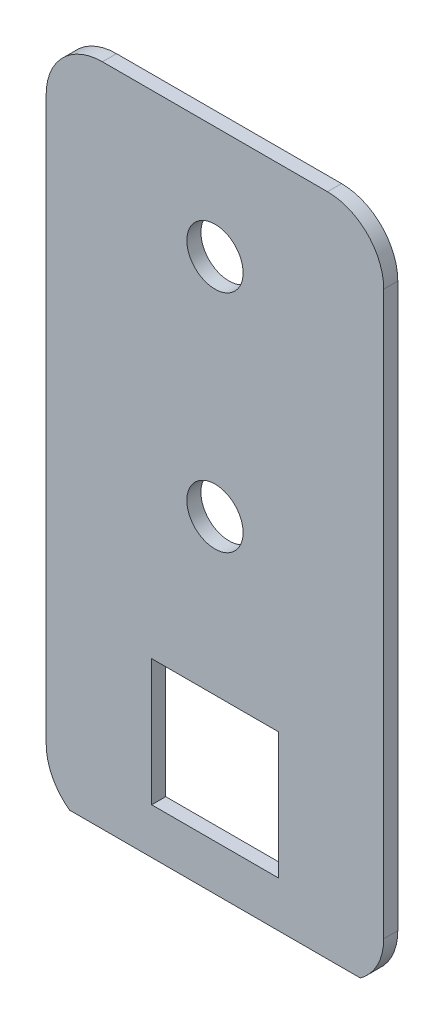
ISO-10303-21;
HEADER;
FILE_DESCRIPTION(('STEP AP214'),'2;1');
FILE_NAME('part.step','',(''),(''),'','','');
FILE_SCHEMA(('AUTOMOTIVE_DESIGN { 1 0 10303 214 1 1 1 1 }'));
ENDSEC;
DATA;
#1=APPLICATION_CONTEXT('core data for automotive mechanical design processes');
#2=APPLICATION_PROTOCOL_DEFINITION('international standard','automotive_design',2000,#1);
#3=PRODUCT_CONTEXT('',#1,'mechanical');
#4=PRODUCT('Part','Part','',(#3));
#5=PRODUCT_RELATED_PRODUCT_CATEGORY('part','',(#4));
#6=PRODUCT_DEFINITION_FORMATION('','',#4);
#7=PRODUCT_DEFINITION_CONTEXT('part definition',#1,'design');
#8=PRODUCT_DEFINITION('design','',#6,#7);
#9=PRODUCT_DEFINITION_SHAPE('','',#8);
#10=(LENGTH_UNIT() NAMED_UNIT(*) SI_UNIT(.MILLI.,.METRE.));
#11=(NAMED_UNIT(*) PLANE_ANGLE_UNIT() SI_UNIT($,.RADIAN.));
#12=(NAMED_UNIT(*) SI_UNIT($,.STERADIAN.) SOLID_ANGLE_UNIT());
#13=UNCERTAINTY_MEASURE_WITH_UNIT(LENGTH_MEASURE(1.E-05),#10,'distance_accuracy_value','');
#14=(GEOMETRIC_REPRESENTATION_CONTEXT(3) GLOBAL_UNCERTAINTY_ASSIGNED_CONTEXT((#13)) GLOBAL_UNIT_ASSIGNED_CONTEXT((#10,
#11,#12)) REPRESENTATION_CONTEXT('',''));
#15=CARTESIAN_POINT('',(0.,0.,0.));
#16=DIRECTION('',(0.,0.,1.));
#17=DIRECTION('',(1.,0.,0.));
#18=AXIS2_PLACEMENT_3D('',#15,#16,#17);
#19=CARTESIAN_POINT('',(6.35,69.85,1.5875));
#20=DIRECTION('',(0.,0.,-1.));
#21=DIRECTION('',(-1.,0.,0.));
#22=AXIS2_PLACEMENT_3D('',#19,#20,#21);
#23=PLANE('',#22);
#24=CARTESIAN_POINT('',(6.35,6.35,1.5875));
#25=DIRECTION('',(0.,0.,1.));
#26=DIRECTION('',(-1.,0.,0.));
#27=AXIS2_PLACEMENT_3D('',#24,#25,#26);
#28=CIRCLE('',#27,6.35);
#29=CARTESIAN_POINT('',(0.,6.35000000000004,1.5875));
#30=VERTEX_POINT('',#29);
#31=CARTESIAN_POINT('',(2.64819643830539,1.19062499999999,1.5875));
#32=VERTEX_POINT('',#31);
#33=EDGE_CURVE('E144',#30,#32,#28,.T.);
#34=ORIENTED_EDGE('',*,*,#33,.T.);
#35=DIRECTION('',(-1.,0.,0.));
#36=VECTOR('',#35,1.);
#37=CARTESIAN_POINT('',(76.2,1.19062499999999,1.5875));
#38=LINE('',#37,#36);
#39=CARTESIAN_POINT('',(35.4518035616946,1.19062499999999,1.5875));
#40=VERTEX_POINT('',#39);
#41=EDGE_CURVE('E133',#40,#32,#38,.T.);
#42=ORIENTED_EDGE('',*,*,#41,.F.);
#43=CARTESIAN_POINT('',(31.75,6.35,1.5875));
#44=DIRECTION('',(0.,0.,1.));
#45=DIRECTION('',(1.,0.,0.));
#46=AXIS2_PLACEMENT_3D('',#43,#44,#45);
#47=CIRCLE('',#46,6.35);
#48=CARTESIAN_POINT('',(38.1,6.35,1.5875));
#49=VERTEX_POINT('',#48);
#50=EDGE_CURVE('E141',#40,#49,#47,.T.);
#51=ORIENTED_EDGE('',*,*,#50,.T.);
#52=DIRECTION('',(0.,1.,0.));
#53=VECTOR('',#52,1.);
#54=CARTESIAN_POINT('',(38.1,6.35000000000004,1.5875));
#55=LINE('',#54,#53);
#56=CARTESIAN_POINT('',(38.1,69.85,1.5875));
#57=VERTEX_POINT('',#56);
#58=EDGE_CURVE('E152',#49,#57,#55,.T.);
#59=ORIENTED_EDGE('',*,*,#58,.T.);
#60=CARTESIAN_POINT('',(31.75,69.85,1.5875));
#61=DIRECTION('',(0.,0.,1.));
#62=DIRECTION('',(-1.,0.,0.));
#63=AXIS2_PLACEMENT_3D('',#60,#61,#62);
#64=CIRCLE('',#63,6.35);
#65=CARTESIAN_POINT('',(31.75,76.2,1.5875));
#66=VERTEX_POINT('',#65);
#67=EDGE_CURVE('E156',#57,#66,#64,.T.);
#68=ORIENTED_EDGE('',*,*,#67,.T.);
#69=DIRECTION('',(-1.,0.,0.));
#70=VECTOR('',#69,1.);
#71=CARTESIAN_POINT('',(6.35000000000004,76.2,1.5875));
#72=LINE('',#71,#70);
#73=CARTESIAN_POINT('',(6.35000000000004,76.2,1.5875));
#74=VERTEX_POINT('',#73);
#75=EDGE_CURVE('E164',#66,#74,#72,.T.);
#76=ORIENTED_EDGE('',*,*,#75,.T.);
#77=CARTESIAN_POINT('',(6.35,69.85,1.5875));
#78=DIRECTION('',(0.,0.,1.));
#79=DIRECTION('',(-1.,0.,0.));
#80=AXIS2_PLACEMENT_3D('',#77,#78,#79);
#81=CIRCLE('',#80,6.35);
#82=CARTESIAN_POINT('',(0.,69.85,1.5875));
#83=VERTEX_POINT('',#82);
#84=EDGE_CURVE('E196',#74,#83,#81,.T.);
#85=ORIENTED_EDGE('',*,*,#84,.T.);
#86=DIRECTION('',(0.,-1.,0.));
#87=VECTOR('',#86,1.);
#88=CARTESIAN_POINT('',(0.,6.35000000000004,1.5875));
#89=LINE('',#88,#87);
#90=EDGE_CURVE('E158',#83,#30,#89,.T.);
#91=ORIENTED_EDGE('',*,*,#90,.T.);
#92=EDGE_LOOP('',(#34,#42,#51,#59,#68,#76,#85,#91));
#93=FACE_BOUND('',#92,.T.);
#94=DIRECTION('',(0.,-1.,0.));
#95=VECTOR('',#94,1.);
#96=CARTESIAN_POINT('',(11.90625,6.35,1.5875));
#97=LINE('',#96,#95);
#98=CARTESIAN_POINT('',(11.90625,20.6375,1.5875));
#99=VERTEX_POINT('',#98);
#100=CARTESIAN_POINT('',(11.90625,6.35,1.5875));
#101=VERTEX_POINT('',#100);
#102=EDGE_CURVE('E264',#99,#101,#97,.T.);
#103=ORIENTED_EDGE('',*,*,#102,.F.);
#104=DIRECTION('',(-1.,0.,0.));
#105=VECTOR('',#104,1.);
#106=CARTESIAN_POINT('',(11.90625,20.6375,1.5875));
#107=LINE('',#106,#105);
#108=CARTESIAN_POINT('',(26.19375,20.6375,1.5875));
#109=VERTEX_POINT('',#108);
#110=EDGE_CURVE('E274',#109,#99,#107,.T.);
#111=ORIENTED_EDGE('',*,*,#110,.F.);
#112=DIRECTION('',(0.,1.,0.));
#113=VECTOR('',#112,1.);
#114=CARTESIAN_POINT('',(26.19375,6.35,1.5875));
#115=LINE('',#114,#113);
#116=CARTESIAN_POINT('',(26.19375,6.35,1.5875));
#117=VERTEX_POINT('',#116);
#118=EDGE_CURVE('E271',#117,#109,#115,.T.);
#119=ORIENTED_EDGE('',*,*,#118,.F.);
#120=DIRECTION('',(1.,0.,0.));
#121=VECTOR('',#120,1.);
#122=CARTESIAN_POINT('',(11.90625,6.35,1.5875));
#123=LINE('',#122,#121);
#124=EDGE_CURVE('E267',#101,#117,#123,.T.);
#125=ORIENTED_EDGE('',*,*,#124,.F.);
#126=EDGE_LOOP('',(#103,#111,#119,#125));
#127=FACE_BOUND('',#126,.T.);
#128=CARTESIAN_POINT('',(19.05,38.1,1.5875));
#129=DIRECTION('',(0.,0.,1.));
#130=DIRECTION('',(1.,0.,0.));
#131=AXIS2_PLACEMENT_3D('',#128,#129,#130);
#132=CIRCLE('',#131,3.175);
#133=CARTESIAN_POINT('',(22.225,38.1,1.5875));
#134=VERTEX_POINT('',#133);
#135=EDGE_CURVE('E256',#134,#134,#132,.T.);
#136=ORIENTED_EDGE('',*,*,#135,.F.);
#137=EDGE_LOOP('',(#136));
#138=FACE_BOUND('',#137,.T.);
#139=CARTESIAN_POINT('',(19.05,63.5,1.5875));
#140=DIRECTION('',(0.,0.,1.));
#141=DIRECTION('',(1.,0.,0.));
#142=AXIS2_PLACEMENT_3D('',#139,#140,#141);
#143=CIRCLE('',#142,3.175);
#144=CARTESIAN_POINT('',(22.225,63.5,1.5875));
#145=VERTEX_POINT('',#144);
#146=EDGE_CURVE('E248',#145,#145,#143,.T.);
#147=ORIENTED_EDGE('',*,*,#146,.F.);
#148=EDGE_LOOP('',(#147));
#149=FACE_BOUND('',#148,.T.);
#150=ADVANCED_FACE('F39',(#93,#127,#138,#149),#23,.F.);
#151=CARTESIAN_POINT('',(6.35,69.85,0.));
#152=DIRECTION('',(0.,0.,-1.));
#153=DIRECTION('',(-1.,0.,0.));
#154=AXIS2_PLACEMENT_3D('',#151,#152,#153);
#155=PLANE('',#154);
#156=CARTESIAN_POINT('',(19.05,38.1,0.));
#157=DIRECTION('',(0.,0.,1.));
#158=DIRECTION('',(1.,0.,0.));
#159=AXIS2_PLACEMENT_3D('',#156,#157,#158);
#160=CIRCLE('',#159,3.175);
#161=CARTESIAN_POINT('',(22.225,38.1,0.));
#162=VERTEX_POINT('',#161);
#163=EDGE_CURVE('E254',#162,#162,#160,.T.);
#164=ORIENTED_EDGE('',*,*,#163,.T.);
#165=EDGE_LOOP('',(#164));
#166=FACE_BOUND('',#165,.T.);
#167=CARTESIAN_POINT('',(6.35,69.85,0.));
#168=DIRECTION('',(0.,0.,1.));
#169=DIRECTION('',(-1.,0.,0.));
#170=AXIS2_PLACEMENT_3D('',#167,#168,#169);
#171=CIRCLE('',#170,6.35);
#172=CARTESIAN_POINT('',(6.35000000000004,76.2,0.));
#173=VERTEX_POINT('',#172);
#174=CARTESIAN_POINT('',(0.,69.85,0.));
#175=VERTEX_POINT('',#174);
#176=EDGE_CURVE('E168',#173,#175,#171,.T.);
#177=ORIENTED_EDGE('',*,*,#176,.F.);
#178=DIRECTION('',(-1.,0.,0.));
#179=VECTOR('',#178,1.);
#180=CARTESIAN_POINT('',(6.35000000000004,76.2,0.));
#181=LINE('',#180,#179);
#182=CARTESIAN_POINT('',(31.75,76.2,0.));
#183=VERTEX_POINT('',#182);
#184=EDGE_CURVE('E193',#183,#173,#181,.T.);
#185=ORIENTED_EDGE('',*,*,#184,.F.);
#186=CARTESIAN_POINT('',(31.75,69.85,0.));
#187=DIRECTION('',(0.,0.,1.));
#188=DIRECTION('',(-1.,0.,0.));
#189=AXIS2_PLACEMENT_3D('',#186,#187,#188);
#190=CIRCLE('',#189,6.35);
#191=CARTESIAN_POINT('',(38.1,69.85,0.));
#192=VERTEX_POINT('',#191);
#193=EDGE_CURVE('E190',#192,#183,#190,.T.);
#194=ORIENTED_EDGE('',*,*,#193,.F.);
#195=DIRECTION('',(0.,1.,0.));
#196=VECTOR('',#195,1.);
#197=CARTESIAN_POINT('',(38.1,6.35000000000004,0.));
#198=LINE('',#197,#196);
#199=CARTESIAN_POINT('',(38.1,6.35,0.));
#200=VERTEX_POINT('',#199);
#201=EDGE_CURVE('E187',#200,#192,#198,.T.);
#202=ORIENTED_EDGE('',*,*,#201,.F.);
#203=CARTESIAN_POINT('',(31.75,6.35,0.));
#204=DIRECTION('',(0.,0.,1.));
#205=DIRECTION('',(1.,0.,0.));
#206=AXIS2_PLACEMENT_3D('',#203,#204,#205);
#207=CIRCLE('',#206,6.35);
#208=CARTESIAN_POINT('',(31.75,0.,0.));
#209=VERTEX_POINT('',#208);
#210=EDGE_CURVE('E184',#209,#200,#207,.T.);
#211=ORIENTED_EDGE('',*,*,#210,.F.);
#212=DIRECTION('',(1.,0.,0.));
#213=VECTOR('',#212,1.);
#214=CARTESIAN_POINT('',(6.35000000000004,0.,0.));
#215=LINE('',#214,#213);
#216=CARTESIAN_POINT('',(6.35000000000004,0.,0.));
#217=VERTEX_POINT('',#216);
#218=EDGE_CURVE('E180',#217,#209,#215,.T.);
#219=ORIENTED_EDGE('',*,*,#218,.F.);
#220=CARTESIAN_POINT('',(6.35,6.35,0.));
#221=DIRECTION('',(0.,0.,1.));
#222=DIRECTION('',(-1.,0.,0.));
#223=AXIS2_PLACEMENT_3D('',#220,#221,#222);
#224=CIRCLE('',#223,6.35);
#225=CARTESIAN_POINT('',(0.,6.35000000000004,0.));
#226=VERTEX_POINT('',#225);
#227=EDGE_CURVE('E176',#226,#217,#224,.T.);
#228=ORIENTED_EDGE('',*,*,#227,.F.);
#229=DIRECTION('',(0.,-1.,0.));
#230=VECTOR('',#229,1.);
#231=CARTESIAN_POINT('',(0.,6.35000000000004,0.));
#232=LINE('',#231,#230);
#233=EDGE_CURVE('E172',#175,#226,#232,.T.);
#234=ORIENTED_EDGE('',*,*,#233,.F.);
#235=EDGE_LOOP('',(#177,#185,#194,#202,#211,#219,#228,#234));
#236=FACE_BOUND('',#235,.T.);
#237=DIRECTION('',(-1.,0.,0.));
#238=VECTOR('',#237,1.);
#239=CARTESIAN_POINT('',(11.90625,20.6375,0.));
#240=LINE('',#239,#238);
#241=CARTESIAN_POINT('',(26.19375,20.6375,0.));
#242=VERTEX_POINT('',#241);
#243=CARTESIAN_POINT('',(11.90625,20.6375,0.));
#244=VERTEX_POINT('',#243);
#245=EDGE_CURVE('E268',#242,#244,#240,.T.);
#246=ORIENTED_EDGE('',*,*,#245,.T.);
#247=DIRECTION('',(0.,-1.,0.));
#248=VECTOR('',#247,1.);
#249=CARTESIAN_POINT('',(11.90625,6.35,0.));
#250=LINE('',#249,#248);
#251=CARTESIAN_POINT('',(11.90625,6.35,0.));
#252=VERTEX_POINT('',#251);
#253=EDGE_CURVE('E260',#244,#252,#250,.T.);
#254=ORIENTED_EDGE('',*,*,#253,.T.);
#255=DIRECTION('',(1.,0.,0.));
#256=VECTOR('',#255,1.);
#257=CARTESIAN_POINT('',(11.90625,6.35,0.));
#258=LINE('',#257,#256);
#259=CARTESIAN_POINT('',(26.19375,6.35,0.));
#260=VERTEX_POINT('',#259);
#261=EDGE_CURVE('E281',#252,#260,#258,.T.);
#262=ORIENTED_EDGE('',*,*,#261,.T.);
#263=DIRECTION('',(0.,1.,0.));
#264=VECTOR('',#263,1.);
#265=CARTESIAN_POINT('',(26.19375,6.35,0.));
#266=LINE('',#265,#264);
#267=EDGE_CURVE('E285',#260,#242,#266,.T.);
#268=ORIENTED_EDGE('',*,*,#267,.T.);
#269=EDGE_LOOP('',(#246,#254,#262,#268));
#270=FACE_BOUND('',#269,.T.);
#271=CARTESIAN_POINT('',(19.05,63.5,0.));
#272=DIRECTION('',(0.,0.,1.));
#273=DIRECTION('',(1.,0.,0.));
#274=AXIS2_PLACEMENT_3D('',#271,#272,#273);
#275=CIRCLE('',#274,3.175);
#276=CARTESIAN_POINT('',(22.225,63.5,0.));
#277=VERTEX_POINT('',#276);
#278=EDGE_CURVE('E243',#277,#277,#275,.T.);
#279=ORIENTED_EDGE('',*,*,#278,.T.);
#280=EDGE_LOOP('',(#279));
#281=FACE_BOUND('',#280,.T.);
#282=ADVANCED_FACE('F232',(#166,#236,#270,#281),#155,.T.);
#283=CARTESIAN_POINT('',(6.35,69.85,1.5875));
#284=DIRECTION('',(0.,0.,-1.));
#285=DIRECTION('',(-1.,0.,0.));
#286=AXIS2_PLACEMENT_3D('',#283,#284,#285);
#287=CYLINDRICAL_SURFACE('',#286,6.35);
#288=ORIENTED_EDGE('',*,*,#176,.T.);
#289=DIRECTION('',(0.,0.,-1.));
#290=VECTOR('',#289,1.);
#291=CARTESIAN_POINT('',(0.,69.85,1.5875));
#292=LINE('',#291,#290);
#293=EDGE_CURVE('E48',#83,#175,#292,.T.);
#294=ORIENTED_EDGE('',*,*,#293,.F.);
#295=ORIENTED_EDGE('',*,*,#84,.F.);
#296=DIRECTION('',(0.,0.,-1.));
#297=VECTOR('',#296,1.);
#298=CARTESIAN_POINT('',(6.35000000000004,76.2,1.5875));
#299=LINE('',#298,#297);
#300=EDGE_CURVE('E167',#74,#173,#299,.T.);
#301=ORIENTED_EDGE('',*,*,#300,.T.);
#302=EDGE_LOOP('',(#288,#294,#295,#301));
#303=FACE_BOUND('',#302,.T.);
#304=ADVANCED_FACE('F41',(#303),#287,.T.);
#305=CARTESIAN_POINT('',(0.,6.35000000000004,1.5875));
#306=DIRECTION('',(1.,0.,0.));
#307=DIRECTION('',(0.,0.,-1.));
#308=AXIS2_PLACEMENT_3D('',#305,#306,#307);
#309=PLANE('',#308);
#310=ORIENTED_EDGE('',*,*,#233,.T.);
#311=DIRECTION('',(0.,0.,-1.));
#312=VECTOR('',#311,1.);
#313=CARTESIAN_POINT('',(0.,6.35000000000004,1.5875));
#314=LINE('',#313,#312);
#315=EDGE_CURVE('E216',#30,#226,#314,.T.);
#316=ORIENTED_EDGE('',*,*,#315,.F.);
#317=ORIENTED_EDGE('',*,*,#90,.F.);
#318=ORIENTED_EDGE('',*,*,#293,.T.);
#319=EDGE_LOOP('',(#310,#316,#317,#318));
#320=FACE_BOUND('',#319,.T.);
#321=ADVANCED_FACE('F223',(#320),#309,.F.);
#322=CARTESIAN_POINT('',(6.35,6.35,1.5875));
#323=DIRECTION('',(0.,0.,-1.));
#324=DIRECTION('',(-1.,0.,0.));
#325=AXIS2_PLACEMENT_3D('',#322,#323,#324);
#326=CYLINDRICAL_SURFACE('',#325,6.35);
#327=DIRECTION('',(0.,0.,-1.));
#328=VECTOR('',#327,1.);
#329=CARTESIAN_POINT('',(6.35000000000004,0.,1.5875));
#330=LINE('',#329,#328);
#331=CARTESIAN_POINT('',(6.35000000000008,0.,0.396875));
#332=VERTEX_POINT('',#331);
#333=EDGE_CURVE('E213',#332,#217,#330,.T.);
#334=ORIENTED_EDGE('',*,*,#333,.F.);
#335=CARTESIAN_POINT('',(6.35,6.35,6.74687500000006));
#336=DIRECTION('',(0.,0.707106781186551,-0.707106781186544));
#337=DIRECTION('',(0.,-0.707106781186544,-0.707106781186551));
#338=AXIS2_PLACEMENT_3D('',#335,#336,#337);
#339=ELLIPSE('',#338,8.9802561210692,6.35);
#340=EDGE_CURVE('E241',#332,#32,#339,.T.);
#341=ORIENTED_EDGE('',*,*,#340,.T.);
#342=ORIENTED_EDGE('',*,*,#33,.F.);
#343=ORIENTED_EDGE('',*,*,#315,.T.);
#344=ORIENTED_EDGE('',*,*,#227,.T.);
#345=EDGE_LOOP('',(#334,#341,#342,#343,#344));
#346=FACE_BOUND('',#345,.T.);
#347=ADVANCED_FACE('F240',(#346),#326,.T.);
#348=CARTESIAN_POINT('',(6.35000000000004,0.,1.5875));
#349=DIRECTION('',(0.,1.,0.));
#350=DIRECTION('',(0.,0.,1.));
#351=AXIS2_PLACEMENT_3D('',#348,#349,#350);
#352=PLANE('',#351);
#353=DIRECTION('',(0.,0.,-1.));
#354=VECTOR('',#353,1.);
#355=CARTESIAN_POINT('',(31.75,0.,1.5875));
#356=LINE('',#355,#354);
#357=CARTESIAN_POINT('',(31.75,0.,0.396875));
#358=VERTEX_POINT('',#357);
#359=EDGE_CURVE('E210',#358,#209,#356,.T.);
#360=ORIENTED_EDGE('',*,*,#359,.F.);
#361=DIRECTION('',(-1.,0.,0.));
#362=VECTOR('',#361,1.);
#363=CARTESIAN_POINT('',(76.2,0.,0.396875));
#364=LINE('',#363,#362);
#365=EDGE_CURVE('E55',#358,#332,#364,.T.);
#366=ORIENTED_EDGE('',*,*,#365,.T.);
#367=ORIENTED_EDGE('',*,*,#333,.T.);
#368=ORIENTED_EDGE('',*,*,#218,.T.);
#369=EDGE_LOOP('',(#360,#366,#367,#368));
#370=FACE_BOUND('',#369,.T.);
#371=ADVANCED_FACE('F323',(#370),#352,.F.);
#372=CARTESIAN_POINT('',(31.75,6.35,1.5875));
#373=DIRECTION('',(0.,0.,-1.));
#374=DIRECTION('',(-1.,0.,0.));
#375=AXIS2_PLACEMENT_3D('',#372,#373,#374);
#376=CYLINDRICAL_SURFACE('',#375,6.35);
#377=ORIENTED_EDGE('',*,*,#50,.F.);
#378=CARTESIAN_POINT('',(31.75,6.35,6.74687500000006));
#379=DIRECTION('',(0.,0.707106781186551,-0.707106781186544));
#380=DIRECTION('',(0.,-0.707106781186544,-0.707106781186551));
#381=AXIS2_PLACEMENT_3D('',#378,#379,#380);
#382=ELLIPSE('',#381,8.9802561210692,6.35);
#383=EDGE_CURVE('E11',#40,#358,#382,.T.);
#384=ORIENTED_EDGE('',*,*,#383,.T.);
#385=ORIENTED_EDGE('',*,*,#359,.T.);
#386=ORIENTED_EDGE('',*,*,#210,.T.);
#387=DIRECTION('',(0.,0.,-1.));
#388=VECTOR('',#387,1.);
#389=CARTESIAN_POINT('',(38.1,6.35,1.5875));
#390=LINE('',#389,#388);
#391=EDGE_CURVE('E149',#49,#200,#390,.T.);
#392=ORIENTED_EDGE('',*,*,#391,.F.);
#393=EDGE_LOOP('',(#377,#384,#385,#386,#392));
#394=FACE_BOUND('',#393,.T.);
#395=ADVANCED_FACE('F147',(#394),#376,.T.);
#396=CARTESIAN_POINT('',(38.1,6.35000000000004,1.5875));
#397=DIRECTION('',(-1.,0.,0.));
#398=DIRECTION('',(0.,0.,1.));
#399=AXIS2_PLACEMENT_3D('',#396,#397,#398);
#400=PLANE('',#399);
#401=ORIENTED_EDGE('',*,*,#201,.T.);
#402=DIRECTION('',(0.,0.,-1.));
#403=VECTOR('',#402,1.);
#404=CARTESIAN_POINT('',(38.1,69.85,1.5875));
#405=LINE('',#404,#403);
#406=EDGE_CURVE('E204',#57,#192,#405,.T.);
#407=ORIENTED_EDGE('',*,*,#406,.F.);
#408=ORIENTED_EDGE('',*,*,#58,.F.);
#409=ORIENTED_EDGE('',*,*,#391,.T.);
#410=EDGE_LOOP('',(#401,#407,#408,#409));
#411=FACE_BOUND('',#410,.T.);
#412=ADVANCED_FACE('F315',(#411),#400,.F.);
#413=CARTESIAN_POINT('',(31.75,69.85,1.5875));
#414=DIRECTION('',(0.,0.,-1.));
#415=DIRECTION('',(-1.,0.,0.));
#416=AXIS2_PLACEMENT_3D('',#413,#414,#415);
#417=CYLINDRICAL_SURFACE('',#416,6.35);
#418=ORIENTED_EDGE('',*,*,#193,.T.);
#419=DIRECTION('',(0.,0.,-1.));
#420=VECTOR('',#419,1.);
#421=CARTESIAN_POINT('',(31.75,76.2,1.5875));
#422=LINE('',#421,#420);
#423=EDGE_CURVE('E200',#66,#183,#422,.T.);
#424=ORIENTED_EDGE('',*,*,#423,.F.);
#425=ORIENTED_EDGE('',*,*,#67,.F.);
#426=ORIENTED_EDGE('',*,*,#406,.T.);
#427=EDGE_LOOP('',(#418,#424,#425,#426));
#428=FACE_BOUND('',#427,.T.);
#429=ADVANCED_FACE('F311',(#428),#417,.T.);
#430=CARTESIAN_POINT('',(6.35000000000004,76.2,1.5875));
#431=DIRECTION('',(0.,-1.,0.));
#432=DIRECTION('',(0.,0.,-1.));
#433=AXIS2_PLACEMENT_3D('',#430,#431,#432);
#434=PLANE('',#433);
#435=ORIENTED_EDGE('',*,*,#184,.T.);
#436=ORIENTED_EDGE('',*,*,#300,.F.);
#437=ORIENTED_EDGE('',*,*,#75,.F.);
#438=ORIENTED_EDGE('',*,*,#423,.T.);
#439=EDGE_LOOP('',(#435,#436,#437,#438));
#440=FACE_BOUND('',#439,.T.);
#441=ADVANCED_FACE('F309',(#440),#434,.F.);
#442=CARTESIAN_POINT('',(11.90625,6.35,1.5875));
#443=DIRECTION('',(1.,0.,0.));
#444=DIRECTION('',(0.,0.,-1.));
#445=AXIS2_PLACEMENT_3D('',#442,#443,#444);
#446=PLANE('',#445);
#447=ORIENTED_EDGE('',*,*,#253,.F.);
#448=DIRECTION('',(0.,0.,-1.));
#449=VECTOR('',#448,1.);
#450=CARTESIAN_POINT('',(11.90625,20.6375,1.5875));
#451=LINE('',#450,#449);
#452=EDGE_CURVE('E277',#99,#244,#451,.T.);
#453=ORIENTED_EDGE('',*,*,#452,.F.);
#454=ORIENTED_EDGE('',*,*,#102,.T.);
#455=DIRECTION('',(0.,0.,-1.));
#456=VECTOR('',#455,1.);
#457=CARTESIAN_POINT('',(11.90625,6.35,1.5875));
#458=LINE('',#457,#456);
#459=EDGE_CURVE('E173',#101,#252,#458,.T.);
#460=ORIENTED_EDGE('',*,*,#459,.T.);
#461=EDGE_LOOP('',(#447,#453,#454,#460));
#462=FACE_BOUND('',#461,.T.);
#463=ADVANCED_FACE('F333',(#462),#446,.T.);
#464=CARTESIAN_POINT('',(11.90625,6.35,1.5875));
#465=DIRECTION('',(0.,1.,0.));
#466=DIRECTION('',(0.,0.,1.));
#467=AXIS2_PLACEMENT_3D('',#464,#465,#466);
#468=PLANE('',#467);
#469=ORIENTED_EDGE('',*,*,#261,.F.);
#470=ORIENTED_EDGE('',*,*,#459,.F.);
#471=ORIENTED_EDGE('',*,*,#124,.T.);
#472=DIRECTION('',(0.,0.,-1.));
#473=VECTOR('',#472,1.);
#474=CARTESIAN_POINT('',(26.19375,6.35,1.5875));
#475=LINE('',#474,#473);
#476=EDGE_CURVE('E297',#117,#260,#475,.T.);
#477=ORIENTED_EDGE('',*,*,#476,.T.);
#478=EDGE_LOOP('',(#469,#470,#471,#477));
#479=FACE_BOUND('',#478,.T.);
#480=ADVANCED_FACE('F340',(#479),#468,.T.);
#481=CARTESIAN_POINT('',(26.19375,6.35,1.5875));
#482=DIRECTION('',(-1.,0.,0.));
#483=DIRECTION('',(0.,0.,1.));
#484=AXIS2_PLACEMENT_3D('',#481,#482,#483);
#485=PLANE('',#484);
#486=ORIENTED_EDGE('',*,*,#267,.F.);
#487=ORIENTED_EDGE('',*,*,#476,.F.);
#488=ORIENTED_EDGE('',*,*,#118,.T.);
#489=DIRECTION('',(0.,0.,-1.));
#490=VECTOR('',#489,1.);
#491=CARTESIAN_POINT('',(26.19375,20.6375,1.5875));
#492=LINE('',#491,#490);
#493=EDGE_CURVE('E62',#109,#242,#492,.T.);
#494=ORIENTED_EDGE('',*,*,#493,.T.);
#495=EDGE_LOOP('',(#486,#487,#488,#494));
#496=FACE_BOUND('',#495,.T.);
#497=ADVANCED_FACE('F345',(#496),#485,.T.);
#498=CARTESIAN_POINT('',(11.90625,20.6375,1.5875));
#499=DIRECTION('',(0.,-1.,0.));
#500=DIRECTION('',(0.,0.,-1.));
#501=AXIS2_PLACEMENT_3D('',#498,#499,#500);
#502=PLANE('',#501);
#503=ORIENTED_EDGE('',*,*,#245,.F.);
#504=ORIENTED_EDGE('',*,*,#493,.F.);
#505=ORIENTED_EDGE('',*,*,#110,.T.);
#506=ORIENTED_EDGE('',*,*,#452,.T.);
#507=EDGE_LOOP('',(#503,#504,#505,#506));
#508=FACE_BOUND('',#507,.T.);
#509=ADVANCED_FACE('F350',(#508),#502,.T.);
#510=CARTESIAN_POINT('',(19.05,38.1,1.5875));
#511=DIRECTION('',(0.,0.,-1.));
#512=DIRECTION('',(-1.,0.,0.));
#513=AXIS2_PLACEMENT_3D('',#510,#511,#512);
#514=CYLINDRICAL_SURFACE('',#513,3.175);
#515=ORIENTED_EDGE('',*,*,#135,.T.);
#516=EDGE_LOOP('',(#515));
#517=FACE_BOUND('',#516,.T.);
#518=ORIENTED_EDGE('',*,*,#163,.F.);
#519=EDGE_LOOP('',(#518));
#520=FACE_BOUND('',#519,.T.);
#521=ADVANCED_FACE('F366',(#517,#520),#514,.F.);
#522=CARTESIAN_POINT('',(19.05,63.5,1.5875));
#523=DIRECTION('',(0.,0.,-1.));
#524=DIRECTION('',(-1.,0.,0.));
#525=AXIS2_PLACEMENT_3D('',#522,#523,#524);
#526=CYLINDRICAL_SURFACE('',#525,3.175);
#527=ORIENTED_EDGE('',*,*,#146,.T.);
#528=EDGE_LOOP('',(#527));
#529=FACE_BOUND('',#528,.T.);
#530=ORIENTED_EDGE('',*,*,#278,.F.);
#531=EDGE_LOOP('',(#530));
#532=FACE_BOUND('',#531,.T.);
#533=ADVANCED_FACE('F363',(#529,#532),#526,.F.);
#534=CARTESIAN_POINT('',(76.2,0.,0.396875));
#535=DIRECTION('',(0.,0.707106781186551,-0.707106781186544));
#536=DIRECTION('',(0.,0.707106781186544,0.707106781186551));
#537=AXIS2_PLACEMENT_3D('',#534,#535,#536);
#538=PLANE('',#537);
#539=ORIENTED_EDGE('',*,*,#365,.F.);
#540=ORIENTED_EDGE('',*,*,#383,.F.);
#541=ORIENTED_EDGE('',*,*,#41,.T.);
#542=ORIENTED_EDGE('',*,*,#340,.F.);
#543=EDGE_LOOP('',(#539,#540,#541,#542));
#544=FACE_BOUND('',#543,.T.);
#545=ADVANCED_FACE('F132',(#544),#538,.F.);
#546=CLOSED_SHELL('',(#150,#282,#304,#321,#347,#371,#395,#412,#429,#441,#463,#480,#497,#509,
#521,#533,#545));
#547=MANIFOLD_SOLID_BREP('B2',#546);
#548=ADVANCED_BREP_SHAPE_REPRESENTATION('',(#18,#547),#14);
#549=SHAPE_DEFINITION_REPRESENTATION(#9,#548);
ENDSEC;
END-ISO-10303-21;
